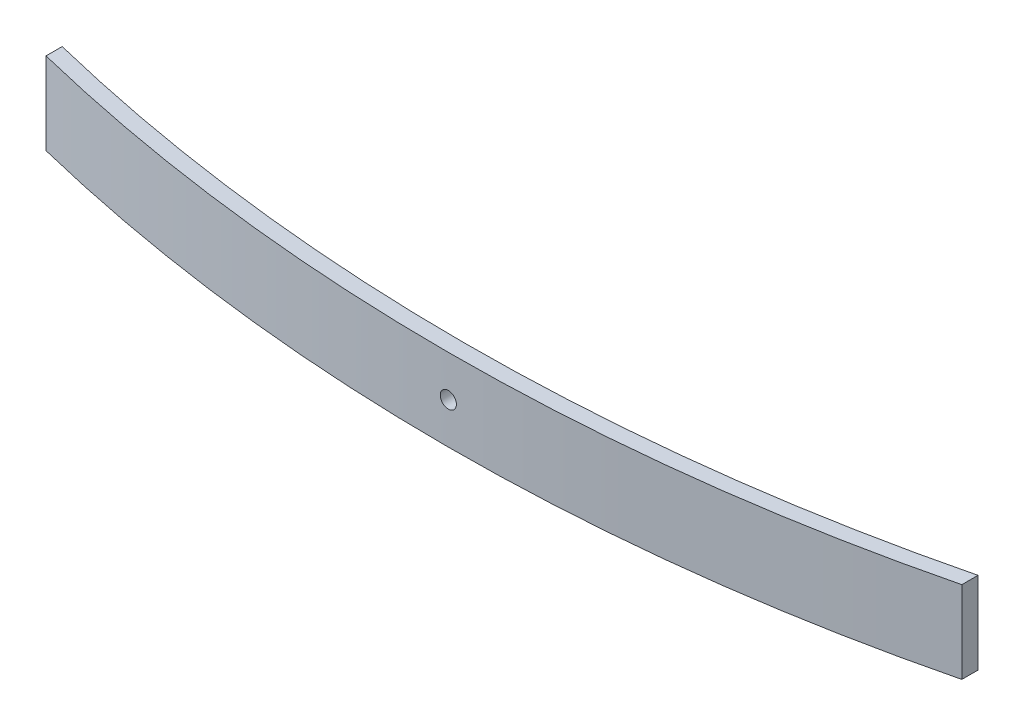
ISO-10303-21;
HEADER;
FILE_DESCRIPTION(('STEP AP214'),'2;1');
FILE_NAME('part.step','',(''),(''),'','','');
FILE_SCHEMA(('AUTOMOTIVE_DESIGN { 1 0 10303 214 1 1 1 1 }'));
ENDSEC;
DATA;
#1=APPLICATION_CONTEXT('core data for automotive mechanical design processes');
#2=APPLICATION_PROTOCOL_DEFINITION('international standard','automotive_design',2000,#1);
#3=PRODUCT_CONTEXT('',#1,'mechanical');
#4=PRODUCT('Part','Part','',(#3));
#5=PRODUCT_RELATED_PRODUCT_CATEGORY('part','',(#4));
#6=PRODUCT_DEFINITION_FORMATION('','',#4);
#7=PRODUCT_DEFINITION_CONTEXT('part definition',#1,'design');
#8=PRODUCT_DEFINITION('design','',#6,#7);
#9=PRODUCT_DEFINITION_SHAPE('','',#8);
#10=(LENGTH_UNIT() NAMED_UNIT(*) SI_UNIT(.MILLI.,.METRE.));
#11=(NAMED_UNIT(*) PLANE_ANGLE_UNIT() SI_UNIT($,.RADIAN.));
#12=(NAMED_UNIT(*) SI_UNIT($,.STERADIAN.) SOLID_ANGLE_UNIT());
#13=UNCERTAINTY_MEASURE_WITH_UNIT(LENGTH_MEASURE(1.E-05),#10,'distance_accuracy_value','');
#14=(GEOMETRIC_REPRESENTATION_CONTEXT(3) GLOBAL_UNCERTAINTY_ASSIGNED_CONTEXT((#13)) GLOBAL_UNIT_ASSIGNED_CONTEXT((#10,
#11,#12)) REPRESENTATION_CONTEXT('',''));
#15=CARTESIAN_POINT('',(0.,0.,0.));
#16=DIRECTION('',(0.,0.,1.));
#17=DIRECTION('',(1.,0.,0.));
#18=AXIS2_PLACEMENT_3D('',#15,#16,#17);
#19=CARTESIAN_POINT('',(5.59449830648205E-13,76.2,-1553.04997748711));
#20=DIRECTION('',(0.,-1.,0.));
#21=DIRECTION('',(0.,0.,-1.));
#22=AXIS2_PLACEMENT_3D('',#19,#20,#21);
#23=CYLINDRICAL_SURFACE('',#22,1776.04997748711);
#24=CARTESIAN_POINT('',(5.59449830648205E-13,0.,-1553.04997748711));
#25=DIRECTION('',(0.,1.,0.));
#26=DIRECTION('',(0.,0.,1.));
#27=AXIS2_PLACEMENT_3D('',#24,#25,#26);
#28=CIRCLE('',#27,1776.04997748711);
#29=CARTESIAN_POINT('',(425.021699517166,0.,171.394883177186));
#30=VERTEX_POINT('',#29);
#31=CARTESIAN_POINT('',(-425.021699517165,0.,171.394883177187));
#32=VERTEX_POINT('',#31);
#33=EDGE_CURVE('E122',#30,#32,#28,.F.);
#34=ORIENTED_EDGE('',*,*,#33,.F.);
#35=DIRECTION('',(0.,-1.,0.));
#36=VECTOR('',#35,1.);
#37=CARTESIAN_POINT('',(425.021699517166,76.2,171.394883177186));
#38=LINE('',#37,#36);
#39=CARTESIAN_POINT('',(425.021699517166,76.2,171.394883177186));
#40=VERTEX_POINT('',#39);
#41=EDGE_CURVE('E11',#40,#30,#38,.T.);
#42=ORIENTED_EDGE('',*,*,#41,.F.);
#43=CARTESIAN_POINT('',(5.59449830648205E-13,76.2,-1553.04997748711));
#44=DIRECTION('',(0.,1.,0.));
#45=DIRECTION('',(0.,0.,1.));
#46=AXIS2_PLACEMENT_3D('',#43,#44,#45);
#47=CIRCLE('',#46,1776.04997748711);
#48=CARTESIAN_POINT('',(-425.021699517165,76.2,171.394883177187));
#49=VERTEX_POINT('',#48);
#50=EDGE_CURVE('E115',#40,#49,#47,.F.);
#51=ORIENTED_EDGE('',*,*,#50,.T.);
#52=DIRECTION('',(0.,-1.,0.));
#53=VECTOR('',#52,1.);
#54=CARTESIAN_POINT('',(-425.021699517165,76.2,171.394883177187));
#55=LINE('',#54,#53);
#56=EDGE_CURVE('E94',#49,#32,#55,.T.);
#57=ORIENTED_EDGE('',*,*,#56,.T.);
#58=EDGE_LOOP('',(#34,#42,#51,#57));
#59=FACE_BOUND('',#58,.T.);
#60=CARTESIAN_POINT('',(5.59449830648205E-13,30.6,223.));
#61=CARTESIAN_POINT('',(-0.210713968094359,30.5999984867718,223.000000017793));
#62=CARTESIAN_POINT('',(-0.421403110930439,30.6088837241473,222.999962421728));
#63=CARTESIAN_POINT('',(-0.841354181845206,30.6443626478278,222.999813125687));
#64=CARTESIAN_POINT('',(-1.05061571988385,30.6709609920997,222.99970140622));
#65=CARTESIAN_POINT('',(-1.46633777348665,30.7417152082758,222.999406859924));
#66=CARTESIAN_POINT('',(-1.67279562512332,30.7858867143382,222.999223969782));
#67=CARTESIAN_POINT('',(-2.08132982906143,30.8914915499315,222.998792209094));
#68=CARTESIAN_POINT('',(-2.28340455125367,30.9529311869031,222.998543314441));
#69=CARTESIAN_POINT('',(-2.68152110119514,31.0925814227027,222.997986836869));
#70=CARTESIAN_POINT('',(-2.8775668723038,31.1707807807114,222.997679293301));
#71=CARTESIAN_POINT('',(-3.26237590887513,31.343419913298,222.997014137911));
#72=CARTESIAN_POINT('',(-3.45113906456097,31.4378599325676,222.996656525334));
#73=CARTESIAN_POINT('',(-3.81998780495984,31.6422805388216,222.995901490769));
#74=CARTESIAN_POINT('',(-4.00007570143485,31.7522569546404,222.995504079474));
#75=CARTESIAN_POINT('',(-4.35035222525608,31.9869905222909,222.994680636078));
#76=CARTESIAN_POINT('',(-4.52054062300119,32.1117480167396,222.994254603313));
#77=CARTESIAN_POINT('',(-4.84979170206691,32.3751451316167,222.99338604845));
#78=CARTESIAN_POINT('',(-5.00885520931077,32.5137837196362,222.992943527578));
#79=CARTESIAN_POINT('',(-5.31479308067798,32.8040158599571,222.992054369382));
#80=CARTESIAN_POINT('',(-5.46166320475911,32.9556138817968,222.991607730686));
#81=CARTESIAN_POINT('',(-5.74206362701615,33.2705952098564,222.990723311728));
#82=CARTESIAN_POINT('',(-5.87559815641346,33.4339747494297,222.990285528692));
#83=CARTESIAN_POINT('',(-6.12847828337025,33.7714630692386,222.989430939819));
#84=CARTESIAN_POINT('',(-6.24781862373899,33.9455757887629,222.989014141786));
#85=CARTESIAN_POINT('',(-6.47138111476831,34.303200530957,222.988213616074));
#86=CARTESIAN_POINT('',(-6.5756063932153,34.4867105983515,222.987829881559));
#87=CARTESIAN_POINT('',(-6.76822875919954,34.8618615632204,222.987106273531));
#88=CARTESIAN_POINT('',(-6.8566256006593,35.0535025870457,222.986766400699));
#89=CARTESIAN_POINT('',(-7.01695887812269,35.4435460971776,222.986140178145));
#90=CARTESIAN_POINT('',(-7.08889566823621,35.6419484379206,222.98585382727));
#91=CARTESIAN_POINT('',(-7.21580133308603,36.0441127387915,222.985342762279));
#92=CARTESIAN_POINT('',(-7.27076981084051,36.2478748241923,222.985118049606));
#93=CARTESIAN_POINT('',(-7.3633369917847,36.6592665254966,222.984736685149));
#94=CARTESIAN_POINT('',(-7.40093897454978,36.8668954034649,222.984580020516));
#95=CARTESIAN_POINT('',(-7.45853120590767,37.2846549482941,222.984339094535));
#96=CARTESIAN_POINT('',(-7.47851535225068,37.4947864564639,222.984254858275));
#97=CARTESIAN_POINT('',(-7.5007035967929,37.9159102543567,222.984161289859));
#98=CARTESIAN_POINT('',(-7.50291408330494,38.12690220753,222.98415193079));
#99=CARTESIAN_POINT('',(-7.48955360463758,38.5484004665778,222.984208322118));
#100=CARTESIAN_POINT('',(-7.47397607404447,38.758906564384,222.984274100248));
#101=CARTESIAN_POINT('',(-7.42514452560695,39.177816026816,222.984478922777));
#102=CARTESIAN_POINT('',(-7.39189401428345,39.3862198002115,222.984617952643));
#103=CARTESIAN_POINT('',(-7.30795445093896,39.799488675094,222.984965325869));
#104=CARTESIAN_POINT('',(-7.25726512758638,40.0043537214696,222.985173670308));
#105=CARTESIAN_POINT('',(-7.13880941808664,40.4090816554469,222.985653753507));
#106=CARTESIAN_POINT('',(-7.07104334628337,40.6089446350508,222.9859254911));
#107=CARTESIAN_POINT('',(-6.9189140997811,41.0022558470399,222.986524655178));
#108=CARTESIAN_POINT('',(-6.83455053674644,41.1957039292103,222.986852082967));
#109=CARTESIAN_POINT('',(-6.64984230973407,41.5747716673118,222.987553267696));
#110=CARTESIAN_POINT('',(-6.54950055498276,41.7603927405774,222.987927016201));
#111=CARTESIAN_POINT('',(-6.33350673998455,42.1225834438656,222.988710406047));
#112=CARTESIAN_POINT('',(-6.21784939085673,42.2991499177422,222.989120059772));
#113=CARTESIAN_POINT('',(-5.97209494733994,42.6418601532704,222.98996341449));
#114=CARTESIAN_POINT('',(-5.84200303653235,42.8080076231481,222.990397106822));
#115=CARTESIAN_POINT('',(-5.56830511634756,43.1287715124284,222.991276344151));
#116=CARTESIAN_POINT('',(-5.42469413510179,43.2833836517495,222.991721893463));
#117=CARTESIAN_POINT('',(-4.97502421482223,43.728168500476,222.993057195178));
#118=CARTESIAN_POINT('',(-4.64986305950523,43.9996590137953,222.993946551662));
#119=CARTESIAN_POINT('',(-4.13197567971263,44.3627081259285,222.995201923407));
#120=CARTESIAN_POINT('',(-3.95423770702148,44.4764002086071,222.99560743072));
#121=CARTESIAN_POINT('',(-3.58980904910994,44.688450679073,222.996381434127));
#122=CARTESIAN_POINT('',(-3.40311815449547,44.7868087079932,222.996749929354));
#123=CARTESIAN_POINT('',(-2.83165300721137,45.0576661242203,222.99778332722));
#124=CARTESIAN_POINT('',(-2.43517114126776,45.2061693090256,222.998376934446));
#125=CARTESIAN_POINT('',(-1.62308827124602,45.4344169166339,222.999304792558));
#126=CARTESIAN_POINT('',(-1.20748726904302,45.5141613461806,222.999639043471));
#127=CARTESIAN_POINT('',(-0.368800144783705,45.6027859953174,223.000011208189));
#128=CARTESIAN_POINT('',(0.0542859194174502,45.6116667624026,223.000049124283));
#129=CARTESIAN_POINT('',(0.89613261813084,45.5581931101372,222.999823726226));
#130=CARTESIAN_POINT('',(1.31489325255125,45.4958386892741,222.999560412068));
#131=CARTESIAN_POINT('',(1.93034367877353,45.3504066256681,222.998962948761));
#132=CARTESIAN_POINT('',(2.13346696571742,45.2932419084604,222.998729895662));
#133=CARTESIAN_POINT('',(2.5341633176814,45.1620457959662,222.998203357605));
#134=CARTESIAN_POINT('',(2.73173651249186,45.0880147954716,222.997909874061));
#135=CARTESIAN_POINT('',(3.31406084676296,44.8412313409883,222.996950242198));
#136=CARTESIAN_POINT('',(3.68878109502314,44.6437020734129,222.996204537468));
#137=CARTESIAN_POINT('',(4.2214817885536,44.3027303934533,222.99499198449));
#138=CARTESIAN_POINT('',(4.39423732139167,44.1815494254653,222.99457188216));
#139=CARTESIAN_POINT('',(4.72893486876232,43.9250760102941,222.993712173887));
#140=CARTESIAN_POINT('',(4.89088085068062,43.7897887877035,222.993272575197));
#141=CARTESIAN_POINT('',(5.20283897410459,43.5060131269227,222.992386135608));
#142=CARTESIAN_POINT('',(5.35284682055907,43.3575199778824,222.991939292171));
#143=CARTESIAN_POINT('',(5.63977310900379,43.0484737070597,222.99105133538));
#144=CARTESIAN_POINT('',(5.77669606336983,42.8879247771164,222.990610220097));
#145=CARTESIAN_POINT('',(6.03655633591662,42.5558335361284,222.989746002998));
#146=CARTESIAN_POINT('',(6.15949097179744,42.3842891264948,222.989322904648));
#147=CARTESIAN_POINT('',(6.39046942201523,42.0314575902562,222.98850682996));
#148=CARTESIAN_POINT('',(6.49851358458251,41.8501706916281,222.988113852919));
#149=CARTESIAN_POINT('',(6.69894774113194,41.4791360457972,222.987369158747));
#150=CARTESIAN_POINT('',(6.79133744698049,41.2893881429437,222.987017442377));
#151=CARTESIAN_POINT('',(6.95980221242444,40.9027865931228,222.986365267457));
#152=CARTESIAN_POINT('',(7.03587752593875,40.705933056804,222.986064808109));
#153=CARTESIAN_POINT('',(7.17118720449912,40.3064792017959,222.985523618733));
#154=CARTESIAN_POINT('',(7.23041839084972,40.1038778063372,222.985282899979));
#155=CARTESIAN_POINT('',(7.33158072491739,39.6944803968456,222.98486817799));
#156=CARTESIAN_POINT('',(7.37351824975517,39.4876859585838,222.984694150165));
#157=CARTESIAN_POINT('',(7.43983858987235,39.0712246263163,222.984417572838));
#158=CARTESIAN_POINT('',(7.4642150889778,38.8615567264145,222.984315049055));
#159=CARTESIAN_POINT('',(7.49521005598158,38.4409854893945,222.984184515179));
#160=CARTESIAN_POINT('',(7.50183466739308,38.2300826050058,222.984156479306));
#161=CARTESIAN_POINT('',(7.49729604901428,37.8084313167292,222.984175644233));
#162=CARTESIAN_POINT('',(7.48612970385176,37.5976829463638,222.984222858209));
#163=CARTESIAN_POINT('',(7.44608319144547,37.1778810074965,222.984391205324));
#164=CARTESIAN_POINT('',(7.41720343879291,36.9688273994438,222.984512336734));
#165=CARTESIAN_POINT('',(7.34193498439921,36.5538917028778,222.984825082016));
#166=CARTESIAN_POINT('',(7.29554590651523,36.3480096825967,222.985016697403));
#167=CARTESIAN_POINT('',(7.18558954382438,35.940888673502,222.985464967259));
#168=CARTESIAN_POINT('',(7.12202252604803,35.7396496125665,222.985721620717));
#169=CARTESIAN_POINT('',(6.97814667319743,35.3431999543693,222.986292743017));
#170=CARTESIAN_POINT('',(6.89783430858557,35.1479906380157,222.986607224045));
#171=CARTESIAN_POINT('',(6.72107980430777,34.7651040508121,222.987284909401));
#172=CARTESIAN_POINT('',(6.62464362886664,34.5774240265771,222.987648095704));
#173=CARTESIAN_POINT('',(6.4162729052852,34.210795083937,222.988413096412));
#174=CARTESIAN_POINT('',(6.30433343128906,34.0318489650877,222.988814923083));
#175=CARTESIAN_POINT('',(6.06581689289934,33.684084736122,222.989645553126));
#176=CARTESIAN_POINT('',(5.93924490882288,33.5152631415669,222.990074347111));
#177=CARTESIAN_POINT('',(5.67231991868928,33.1888660580896,222.990946907972));
#178=CARTESIAN_POINT('',(5.53196570521919,33.031291556578,222.991390676157));
#179=CARTESIAN_POINT('',(5.23848659589234,32.728528501031,222.992280544971));
#180=CARTESIAN_POINT('',(5.08536199605376,32.583339660053,222.992726645546));
#181=CARTESIAN_POINT('',(4.76738488124506,32.3063385507571,222.993608647807));
#182=CARTESIAN_POINT('',(4.60252923302727,32.1745298791339,222.994044546725));
#183=CARTESIAN_POINT('',(4.26230143452273,31.9252727160437,222.994893638276));
#184=CARTESIAN_POINT('',(4.08692944268934,31.8078240082911,222.995306831249));
#185=CARTESIAN_POINT('',(3.72679224644641,31.5880456665331,222.996099052417));
#186=CARTESIAN_POINT('',(3.54202080718467,31.4857262486001,222.996478057459));
#187=CARTESIAN_POINT('',(3.16457932589544,31.2970641063271,222.997190684133));
#188=CARTESIAN_POINT('',(2.97191219636475,31.2107155544448,222.997524322307));
#189=CARTESIAN_POINT('',(2.58015719959604,31.0546324777028,222.998136625653));
#190=CARTESIAN_POINT('',(2.38107520557387,30.9848832197952,222.998415339535));
#191=CARTESIAN_POINT('',(1.97781144430207,30.8624129523239,222.998910200255));
#192=CARTESIAN_POINT('',(1.77363103212953,30.8096874689386,222.999126363529));
#193=CARTESIAN_POINT('',(1.31020489979083,30.7106430274462,222.999535351372));
#194=CARTESIAN_POINT('',(1.04990557260813,30.6691871109607,222.99970896714));
#195=CARTESIAN_POINT('',(0.526391255000916,30.6138665423076,222.999941280343));
#196=CARTESIAN_POINT('',(0.263176264593039,30.6000018899827,222.999999977777));
#197=CARTESIAN_POINT('',(5.59449830648205E-13,30.6,223.));
#198=B_SPLINE_CURVE_WITH_KNOTS('',3,(#60,#61,#62,#63,#64,#65,#66,#67,#68,#69,#70,#71,#72,#73,
#74,#75,#76,#77,#78,#79,#80,#81,#82,#83,#84,#85,#86,#87,#88,#89,#90,#91,#92,#93,#94,#95,#96,#97,
#98,#99,#100,#101,#102,#103,#104,#105,#106,#107,#108,#109,#110,#111,#112,#113,#114,#115,#116,
#117,#118,#119,#120,#121,#122,#123,#124,#125,#126,#127,#128,#129,#130,#131,#132,#133,#134,#135,
#136,#137,#138,#139,#140,#141,#142,#143,#144,#145,#146,#147,#148,#149,#150,#151,#152,#153,#154,
#155,#156,#157,#158,#159,#160,#161,#162,#163,#164,#165,#166,#167,#168,#169,#170,#171,#172,#173,
#174,#175,#176,#177,#178,#179,#180,#181,#182,#183,#184,#185,#186,#187,#188,#189,#190,#191,#192,
#193,#194,#195,#196,#197),.UNSPECIFIED.,.T.,.F.,(4,2,2,2,2,2,2,2,2,2,2,2,2,2,2,2,2,2,2,2,2,2,2,
2,2,2,2,2,2,2,2,2,2,2,2,2,2,2,2,2,2,2,2,2,2,2,2,2,2,2,2,2,2,2,2,2,2,2,2,2,2,2,2,2,2,2,2,2,4),
(0.,0.631912024301777,1.2639902864152,1.89663214600144,2.52950538839113,3.16195548087539,
3.79441510307562,4.4267052459563,5.05901004782971,5.69126785680884,6.3237446098031,
6.95602004377836,7.58852893310258,8.22090674891289,8.85329439515874,9.48566843538515,
10.1180572691842,10.7503266306474,11.3828149038618,12.0150758342728,12.6475702025455,
13.2799391235442,13.9123178840565,14.5446850047721,15.177066922899,15.8093338315781,
16.4418196509556,17.0740790696136,17.7065719276866,18.9702098092056,19.602583667419,
20.2349723230349,21.4986105469059,22.7622486468442,24.0258769838608,25.2895053477042,
25.9218869189979,26.5542536895501,27.8178774792359,28.450372115571,29.0826333187677,
29.7151209754032,30.3473897231102,30.9797795065627,31.6121544983652,32.2445411283047,
32.8769179149983,33.5094139599539,34.1416765599364,34.7741664524213,35.4064374266601,
36.0388191299599,36.6711860326123,37.3035665208154,37.9359371792494,38.5684412619989,
39.2007118959496,39.8331838838019,40.4654369370645,41.097745429307,41.7300392686787,
42.3625026260201,42.9949564562123,43.6278354202829,44.2604829982539,44.892566944869,
45.5244846453389,46.3137263294984,47.1029680091572),.UNSPECIFIED.);
#199=CARTESIAN_POINT('',(5.59449830648205E-13,30.6,223.));
#200=VERTEX_POINT('',#199);
#201=EDGE_CURVE('E125',#200,#200,#198,.T.);
#202=ORIENTED_EDGE('',*,*,#201,.T.);
#203=EDGE_LOOP('',(#202));
#204=FACE_BOUND('',#203,.T.);
#205=ADVANCED_FACE('F49',(#59,#204),#23,.T.);
#206=CARTESIAN_POINT('',(5.63227548411192E-13,76.2,-1568.04997748713));
#207=DIRECTION('',(0.,-1.,0.));
#208=DIRECTION('',(0.,0.,-1.));
#209=AXIS2_PLACEMENT_3D('',#206,#207,#208);
#210=CYLINDRICAL_SURFACE('',#209,1776.04997748713);
#211=CARTESIAN_POINT('',(5.63227548411192E-13,0.,-1568.04997748713));
#212=DIRECTION('',(0.,1.,0.));
#213=DIRECTION('',(0.,0.,1.));
#214=AXIS2_PLACEMENT_3D('',#211,#212,#213);
#215=CIRCLE('',#214,1776.04997748713);
#216=CARTESIAN_POINT('',(425.021699517166,0.,156.394883177186));
#217=VERTEX_POINT('',#216);
#218=CARTESIAN_POINT('',(-425.021699517165,0.,156.394883177187));
#219=VERTEX_POINT('',#218);
#220=EDGE_CURVE('E87',#217,#219,#215,.F.);
#221=ORIENTED_EDGE('',*,*,#220,.T.);
#222=DIRECTION('',(0.,-1.,0.));
#223=VECTOR('',#222,1.);
#224=CARTESIAN_POINT('',(-425.021699517165,76.2,156.394883177187));
#225=LINE('',#224,#223);
#226=CARTESIAN_POINT('',(-425.021699517165,76.2,156.394883177187));
#227=VERTEX_POINT('',#226);
#228=EDGE_CURVE('E108',#227,#219,#225,.T.);
#229=ORIENTED_EDGE('',*,*,#228,.F.);
#230=CARTESIAN_POINT('',(5.63227548411192E-13,76.2,-1568.04997748713));
#231=DIRECTION('',(0.,1.,0.));
#232=DIRECTION('',(0.,0.,1.));
#233=AXIS2_PLACEMENT_3D('',#230,#231,#232);
#234=CIRCLE('',#233,1776.04997748713);
#235=CARTESIAN_POINT('',(425.021699517166,76.2,156.394883177186));
#236=VERTEX_POINT('',#235);
#237=EDGE_CURVE('E110',#236,#227,#234,.F.);
#238=ORIENTED_EDGE('',*,*,#237,.F.);
#239=DIRECTION('',(0.,-1.,0.));
#240=VECTOR('',#239,1.);
#241=CARTESIAN_POINT('',(425.021699517166,76.2,156.394883177186));
#242=LINE('',#241,#240);
#243=EDGE_CURVE('E64',#236,#217,#242,.T.);
#244=ORIENTED_EDGE('',*,*,#243,.T.);
#245=EDGE_LOOP('',(#221,#229,#238,#244));
#246=FACE_BOUND('',#245,.T.);
#247=CARTESIAN_POINT('',(-7.5,38.1,207.984164226377));
#248=CARTESIAN_POINT('',(-7.50000151322819,38.3107139680855,207.984164208571));
#249=CARTESIAN_POINT('',(-7.49111627585349,38.5214031109122,207.984201804954));
#250=CARTESIAN_POINT('',(-7.45563735217615,38.9413541818078,207.984351102375));
#251=CARTESIAN_POINT('',(-7.42903900790671,39.1506157198367,207.984462822906));
#252=CARTESIAN_POINT('',(-7.35828479173724,39.56633777342,207.984757371678));
#253=CARTESIAN_POINT('',(-7.31411328567894,39.7727956250468,207.984940263236));
#254=CARTESIAN_POINT('',(-7.208508450096,40.181329828965,207.985372027225));
#255=CARTESIAN_POINT('',(-7.14706881313061,40.3834045511471,207.985620923766));
#256=CARTESIAN_POINT('',(-7.00741857734594,40.781521101067,207.98617740523));
#257=CARTESIAN_POINT('',(-6.92921921934607,40.9775668721644,207.986484950802));
#258=CARTESIAN_POINT('',(-6.75658008677935,41.362375908714,207.987150110131));
#259=CARTESIAN_POINT('',(-6.66214006752074,41.5511390643896,207.987507724643));
#260=CARTESIAN_POINT('',(-6.45771946129041,41.9199878047696,207.988262762777));
#261=CARTESIAN_POINT('',(-6.34774304548433,42.1000757012362,207.988660175705));
#262=CARTESIAN_POINT('',(-6.11300947786033,42.4503522250429,207.989483621892));
#263=CARTESIAN_POINT('',(-5.98825198342546,42.6205406227819,207.989909655814));
#264=CARTESIAN_POINT('',(-5.72485486856214,42.9497917018563,207.990778212374));
#265=CARTESIAN_POINT('',(-5.58621628054089,43.1088552091137,207.991220733785));
#266=CARTESIAN_POINT('',(-5.29598414021393,43.4147930805081,207.992109892413));
#267=CARTESIAN_POINT('',(-5.14438611836974,43.5616632046028,207.992556531002));
#268=CARTESIAN_POINT('',(-4.82940479029845,43.8420636268864,207.993440949047));
#269=CARTESIAN_POINT('',(-4.66602525071787,43.9755981562967,207.993878731278));
#270=CARTESIAN_POINT('',(-4.32853693089197,44.2284782832785,207.994733317997));
#271=CARTESIAN_POINT('',(-4.15442421135789,44.3478186236592,207.99515011468));
#272=CARTESIAN_POINT('',(-3.79679946915635,44.5713811147018,207.995950637268));
#273=CARTESIAN_POINT('',(-3.61328940176485,44.6756063931513,207.996334370008));
#274=CARTESIAN_POINT('',(-3.23813843690194,44.868228759141,207.997057974285));
#275=CARTESIAN_POINT('',(-3.04649741307953,44.9566256006036,207.997397845139));
#276=CARTESIAN_POINT('',(-2.65645390295346,45.116958878073,207.998024063725));
#277=CARTESIAN_POINT('',(-2.4580515622135,45.1888956681897,207.998310412606));
#278=CARTESIAN_POINT('',(-2.05588726134914,45.3158013330459,207.998821473858));
#279=CARTESIAN_POINT('',(-1.85212517595196,45.3707698108037,207.999046184785));
#280=CARTESIAN_POINT('',(-1.44073347465677,45.4633369917546,207.999427546169));
#281=CARTESIAN_POINT('',(-1.23310459669404,45.5009389745232,207.999584209476));
#282=CARTESIAN_POINT('',(-0.815345051876459,45.5585312058889,207.999825133398));
#283=CARTESIAN_POINT('',(-0.605213543712588,45.5785153522362,207.999909368927));
#284=CARTESIAN_POINT('',(-0.184089745831485,45.6007035967881,208.000002936514));
#285=CARTESIAN_POINT('',(0.0269022073360927,45.6029140833055,208.000012295484));
#286=CARTESIAN_POINT('',(0.448400466373139,45.5895536046497,207.999955904647));
#287=CARTESIAN_POINT('',(0.658906564174369,45.5739760740628,207.999890127109));
#288=CARTESIAN_POINT('',(1.07781602663256,45.5251445256344,207.999685306357));
#289=CARTESIAN_POINT('',(1.28621980005893,45.4918940143109,207.999546277678));
#290=CARTESIAN_POINT('',(1.69948867500321,45.407954450961,207.999198907313));
#291=CARTESIAN_POINT('',(1.90435372140974,45.357265127603,207.998990564549));
#292=CARTESIAN_POINT('',(2.30908165544806,45.2388094180872,207.998510484954));
#293=CARTESIAN_POINT('',(2.50894463508202,45.1710433462732,207.998238749291));
#294=CARTESIAN_POINT('',(2.90225584712975,45.0189140997444,207.997639589155));
#295=CARTESIAN_POINT('',(3.09570392932878,44.9345505366938,207.997312163378));
#296=CARTESIAN_POINT('',(3.47477166746599,44.7498423096539,207.996610982502));
#297=CARTESIAN_POINT('',(3.6603927407395,44.6495005548925,207.996237235837));
#298=CARTESIAN_POINT('',(4.02258344404181,44.433506739873,207.995453849319));
#299=CARTESIAN_POINT('',(4.1991499179246,44.3178493907339,207.995044197084));
#300=CARTESIAN_POINT('',(4.5418601534629,44.0720949471939,207.994200844778));
#301=CARTESIAN_POINT('',(4.70800762334451,43.9420030363744,207.993767153369));
#302=CARTESIAN_POINT('',(5.02877151263007,43.6683051161658,207.992887917265));
#303=CARTESIAN_POINT('',(5.18338365195257,43.524694134908,207.992442368252));
#304=CARTESIAN_POINT('',(5.62816850065028,43.075024214623,207.991107066408));
#305=CARTESIAN_POINT('',(5.89965901394052,42.7498630593184,207.990217708469));
#306=CARTESIAN_POINT('',(6.26270812603403,42.231975679552,207.988962332908));
#307=CARTESIAN_POINT('',(6.37640020870004,42.0542377068708,207.988556824049));
#308=CARTESIAN_POINT('',(6.58845067914274,41.689809048981,207.987782817222));
#309=CARTESIAN_POINT('',(6.68680870805227,41.5031181543784,207.987414320118));
#310=CARTESIAN_POINT('',(6.95766612427186,40.9316530070874,207.986380916429));
#311=CARTESIAN_POINT('',(7.10616930907641,40.5351711411231,207.985787305057));
#312=CARTESIAN_POINT('',(7.33441691667697,39.7230882710565,207.98485943989));
#313=CARTESIAN_POINT('',(7.4141613462167,39.3074872688294,207.98452518607));
#314=CARTESIAN_POINT('',(7.50278599532745,38.4688001445599,207.98415301811));
#315=CARTESIAN_POINT('',(7.51166676240022,38.0457140803734,207.984115101681));
#316=CARTESIAN_POINT('',(7.45819311011506,37.2038673816925,207.984340501734));
#317=CARTESIAN_POINT('',(7.39583868924482,36.7851067472898,207.984603818222));
#318=CARTESIAN_POINT('',(7.25040662563846,36.1696563211186,207.985201286275));
#319=CARTESIAN_POINT('',(7.19324190843678,35.9665330342062,207.985434341165));
#320=CARTESIAN_POINT('',(7.06204579596008,35.5658366823044,207.98596088302));
#321=CARTESIAN_POINT('',(6.988014795477,35.3682634875246,207.986254368569));
#322=CARTESIAN_POINT('',(6.74123134103598,34.7859391533421,207.987214006388));
#323=CARTESIAN_POINT('',(6.54370207349932,34.4112189051374,207.987959715012));
#324=CARTESIAN_POINT('',(6.20273039359089,33.8785182116486,207.98917227251));
#325=CARTESIAN_POINT('',(6.08154942560718,33.7057626788045,207.989592376125));
#326=CARTESIAN_POINT('',(5.82507601044284,33.3710651314208,207.990452086404));
#327=CARTESIAN_POINT('',(5.68978878785503,33.2091191494955,207.990891685812));
#328=CARTESIAN_POINT('',(5.40601312707813,32.8971610260567,207.991778126146));
#329=CARTESIAN_POINT('',(5.25751997803879,32.7471531795944,207.992224969611));
#330=CARTESIAN_POINT('',(4.9484737072162,32.4602268911334,207.993112925805));
#331=CARTESIAN_POINT('',(4.78792477727201,32.3233039367589,207.993554040465));
#332=CARTESIAN_POINT('',(4.45583353628019,32.0634436641952,207.994418255711));
#333=CARTESIAN_POINT('',(4.28428912664368,31.9405090283059,207.994841352831));
#334=CARTESIAN_POINT('',(3.9314575903977,31.7095305780716,207.995657424618));
#335=CARTESIAN_POINT('',(3.75017069176505,31.6014864154963,207.996050399988));
#336=CARTESIAN_POINT('',(3.37913604592411,31.4010522589318,207.99679509052));
#337=CARTESIAN_POINT('',(3.18938814306502,31.3086625530762,207.997146804922));
#338=CARTESIAN_POINT('',(2.80278659323258,31.1401977876195,207.997798975874));
#339=CARTESIAN_POINT('',(2.60593305690778,31.0641224740995,207.998099433222));
#340=CARTESIAN_POINT('',(2.20647920190445,30.9288127955346,207.998640618766));
#341=CARTESIAN_POINT('',(2.00387780645707,30.8695816091838,207.998881335688));
#342=CARTESIAN_POINT('',(1.59448039698904,30.7684192751141,207.999296054415));
#343=CARTESIAN_POINT('',(1.38768595873947,30.7264817502745,207.99947008081));
#344=CARTESIAN_POINT('',(0.971224626496976,30.6601614101516,207.999746655793));
#345=CARTESIAN_POINT('',(0.761556726607797,30.6357849110423,207.999849178662));
#346=CARTESIAN_POINT('',(0.340985489613206,30.6047899440287,207.999979711378));
#347=CARTESIAN_POINT('',(0.130082605237182,30.5981653326113,208.000007747002));
#348=CARTESIAN_POINT('',(-0.291568683048701,30.6027039509765,207.999988582247));
#349=CARTESIAN_POINT('',(-0.502317053436057,30.6138702961342,207.99994136869));
#350=CARTESIAN_POINT('',(-0.922118992347881,30.6539168085346,207.999773023057));
#351=CARTESIAN_POINT('',(-1.13117260042308,30.6827965611862,207.99965189271));
#352=CARTESIAN_POINT('',(-1.54610829703443,30.7580650155817,207.999339150039));
#353=CARTESIAN_POINT('',(-1.75199031733826,30.8044540934685,207.9991475362));
#354=CARTESIAN_POINT('',(-2.15911132647842,30.9144104561691,207.998699269789));
#355=CARTESIAN_POINT('',(-2.36035038743661,30.9779774739523,207.998442618228));
#356=CARTESIAN_POINT('',(-2.75680004567823,31.1218533268206,207.997871499834));
#357=CARTESIAN_POINT('',(-2.95200936205342,31.2021656914433,207.997557020813));
#358=CARTESIAN_POINT('',(-3.33489594929876,31.3789201957465,207.99687933939));
#359=CARTESIAN_POINT('',(-3.52257597355381,31.4753563712022,207.996516155014));
#360=CARTESIAN_POINT('',(-3.88920491623113,31.6837270948159,207.995751157795));
#361=CARTESIAN_POINT('',(-4.06815103509761,31.7956665688298,207.995349332688));
#362=CARTESIAN_POINT('',(-4.41591526409443,32.0341831072574,207.994518705298));
#363=CARTESIAN_POINT('',(-4.58473685866347,32.1607550913541,207.994089912401));
#364=CARTESIAN_POINT('',(-4.9111339421384,32.4276800815085,207.993217353088));
#365=CARTESIAN_POINT('',(-5.0687084436356,32.568034294977,207.992773585362));
#366=CARTESIAN_POINT('',(-5.37147149915388,32.8615134042977,207.991883716795));
#367=CARTESIAN_POINT('',(-5.51666034011746,33.0146380041317,207.991437616009));
#368=CARTESIAN_POINT('',(-5.79366144938521,33.3326151189285,207.99055561267));
#369=CARTESIAN_POINT('',(-5.9254701209946,33.4974707671389,207.990119712884));
#370=CARTESIAN_POINT('',(-6.17472728405847,33.8376985656261,207.989270619054));
#371=CARTESIAN_POINT('',(-6.29217599179848,34.0130705574494,207.988857424669));
#372=CARTESIAN_POINT('',(-6.51195433354261,34.3732077536857,207.988065200255));
#373=CARTESIAN_POINT('',(-6.61427375147284,34.5579791929515,207.987686193377));
#374=CARTESIAN_POINT('',(-6.80293589374009,34.935420674249,207.986973562955));
#375=CARTESIAN_POINT('',(-6.88928444561938,35.1280878037838,207.986639922868));
#376=CARTESIAN_POINT('',(-7.04536752235468,35.5198428005607,207.98602761556));
#377=CARTESIAN_POINT('',(-7.11511678025874,35.7189247945869,207.985748899627));
#378=CARTESIAN_POINT('',(-7.23758704772251,36.1221885558675,207.985254035172));
#379=CARTESIAN_POINT('',(-7.29031253110391,36.3263689680447,207.985037870214));
#380=CARTESIAN_POINT('',(-7.38935697257925,36.789795100359,207.984628879072));
#381=CARTESIAN_POINT('',(-7.43081288905515,37.0500944275119,207.984455261811));
#382=CARTESIAN_POINT('',(-7.48613345769553,37.5736087450595,207.984222946583));
#383=CARTESIAN_POINT('',(-7.49999811001735,37.8368237354374,207.984164248617));
#384=CARTESIAN_POINT('',(-7.5,38.1,207.984164226377));
#385=B_SPLINE_CURVE_WITH_KNOTS('',3,(#247,#248,#249,#250,#251,#252,#253,#254,#255,#256,#257,
#258,#259,#260,#261,#262,#263,#264,#265,#266,#267,#268,#269,#270,#271,#272,#273,#274,#275,#276,
#277,#278,#279,#280,#281,#282,#283,#284,#285,#286,#287,#288,#289,#290,#291,#292,#293,#294,#295,
#296,#297,#298,#299,#300,#301,#302,#303,#304,#305,#306,#307,#308,#309,#310,#311,#312,#313,#314,
#315,#316,#317,#318,#319,#320,#321,#322,#323,#324,#325,#326,#327,#328,#329,#330,#331,#332,#333,
#334,#335,#336,#337,#338,#339,#340,#341,#342,#343,#344,#345,#346,#347,#348,#349,#350,#351,#352,
#353,#354,#355,#356,#357,#358,#359,#360,#361,#362,#363,#364,#365,#366,#367,#368,#369,#370,#371,
#372,#373,#374,#375,#376,#377,#378,#379,#380,#381,#382,#383,#384),.UNSPECIFIED.,.T.,.F.,(4,2,2,
2,2,2,2,2,2,2,2,2,2,2,2,2,2,2,2,2,2,2,2,2,2,2,2,2,2,2,2,2,2,2,2,2,2,2,2,2,2,2,2,2,2,2,2,2,2,2,2,
2,2,2,2,2,2,2,2,2,2,2,2,2,2,2,2,2,4),(0.,0.631912024273445,1.26399028635864,1.89663214591711,
2.52950538827904,3.16195548073079,3.79441510289857,4.42670524574721,5.05901004758862,
5.69126785660492,6.32374460963637,6.95602004364789,7.58852893300835,8.22090674880478,
8.85329439503678,9.48566843524987,10.1180572690357,10.7503266304816,11.3828149036786,
12.015075834073,12.6475702023291,13.2799391234167,13.9123178840178,14.5446850048214,
15.1770669230362,15.8093338317406,16.4418196511433,17.0740790698267,17.7065719279251,
18.9702098093706,19.6025836675478,20.2349723231275,21.4986105470723,22.7622486470823,
24.0258769840529,25.2895053478503,25.9218869190543,26.554253689517,27.8178774790259,
28.4503721153762,29.0826333185882,29.7151209752384,30.3473897229599,30.9797795064268,
31.6121544982437,32.2445411281974,32.8769179149054,33.5094139598227,34.1416765597668,
34.7741664522143,35.4064374264159,36.0388191297804,36.6711860324975,37.3035665207648,
37.9359371792628,38.5684412620756,39.2007118960893,39.8331838840045,40.4654369373297,
41.0977454295341,41.7300392688676,42.3625026261715,42.9949564563263,43.6278354204136,
44.2604829984013,44.8925669450324,45.524484645518,46.313726329588,47.1029680091571),.UNSPECIFIED.);
#386=CARTESIAN_POINT('',(-7.5,38.1,207.984164226377));
#387=VERTEX_POINT('',#386);
#388=EDGE_CURVE('E53',#387,#387,#385,.T.);
#389=ORIENTED_EDGE('',*,*,#388,.F.);
#390=EDGE_LOOP('',(#389));
#391=FACE_BOUND('',#390,.T.);
#392=ADVANCED_FACE('F111',(#246,#391),#210,.F.);
#393=CARTESIAN_POINT('',(425.021699517166,76.2,0.));
#394=DIRECTION('',(1.,0.,0.));
#395=DIRECTION('',(0.,0.,-1.));
#396=AXIS2_PLACEMENT_3D('',#393,#394,#395);
#397=PLANE('',#396);
#398=DIRECTION('',(0.,0.,1.));
#399=VECTOR('',#398,1.);
#400=CARTESIAN_POINT('',(425.021699517166,0.,0.));
#401=LINE('',#400,#399);
#402=EDGE_CURVE('E107',#217,#30,#401,.T.);
#403=ORIENTED_EDGE('',*,*,#402,.F.);
#404=ORIENTED_EDGE('',*,*,#243,.F.);
#405=DIRECTION('',(0.,0.,1.));
#406=VECTOR('',#405,1.);
#407=CARTESIAN_POINT('',(425.021699517166,76.2,0.));
#408=LINE('',#407,#406);
#409=EDGE_CURVE('E105',#236,#40,#408,.T.);
#410=ORIENTED_EDGE('',*,*,#409,.T.);
#411=ORIENTED_EDGE('',*,*,#41,.T.);
#412=EDGE_LOOP('',(#403,#404,#410,#411));
#413=FACE_BOUND('',#412,.T.);
#414=ADVANCED_FACE('F103',(#413),#397,.T.);
#415=CARTESIAN_POINT('',(-425.021699517165,76.2,-1.57289625589757E-12));
#416=DIRECTION('',(1.,0.,0.));
#417=DIRECTION('',(0.,0.,-1.));
#418=AXIS2_PLACEMENT_3D('',#415,#416,#417);
#419=PLANE('',#418);
#420=DIRECTION('',(0.,0.,1.));
#421=VECTOR('',#420,1.);
#422=CARTESIAN_POINT('',(-425.021699517165,0.,-1.57289625589757E-12));
#423=LINE('',#422,#421);
#424=EDGE_CURVE('E117',#219,#32,#423,.T.);
#425=ORIENTED_EDGE('',*,*,#424,.T.);
#426=ORIENTED_EDGE('',*,*,#56,.F.);
#427=DIRECTION('',(0.,0.,1.));
#428=VECTOR('',#427,1.);
#429=CARTESIAN_POINT('',(-425.021699517165,76.2,-1.57289625589757E-12));
#430=LINE('',#429,#428);
#431=EDGE_CURVE('E72',#227,#49,#430,.T.);
#432=ORIENTED_EDGE('',*,*,#431,.F.);
#433=ORIENTED_EDGE('',*,*,#228,.T.);
#434=EDGE_LOOP('',(#425,#426,#432,#433));
#435=FACE_BOUND('',#434,.T.);
#436=ADVANCED_FACE('F132',(#435),#419,.F.);
#437=CARTESIAN_POINT('',(0.,76.2,0.));
#438=DIRECTION('',(0.,1.,0.));
#439=DIRECTION('',(0.,0.,1.));
#440=AXIS2_PLACEMENT_3D('',#437,#438,#439);
#441=PLANE('',#440);
#442=ORIENTED_EDGE('',*,*,#50,.F.);
#443=ORIENTED_EDGE('',*,*,#409,.F.);
#444=ORIENTED_EDGE('',*,*,#237,.T.);
#445=ORIENTED_EDGE('',*,*,#431,.T.);
#446=EDGE_LOOP('',(#442,#443,#444,#445));
#447=FACE_BOUND('',#446,.T.);
#448=ADVANCED_FACE('F114',(#447),#441,.T.);
#449=CARTESIAN_POINT('',(0.,0.,0.));
#450=DIRECTION('',(0.,1.,0.));
#451=DIRECTION('',(0.,0.,1.));
#452=AXIS2_PLACEMENT_3D('',#449,#450,#451);
#453=PLANE('',#452);
#454=ORIENTED_EDGE('',*,*,#33,.T.);
#455=ORIENTED_EDGE('',*,*,#424,.F.);
#456=ORIENTED_EDGE('',*,*,#220,.F.);
#457=ORIENTED_EDGE('',*,*,#402,.T.);
#458=EDGE_LOOP('',(#454,#455,#456,#457));
#459=FACE_BOUND('',#458,.T.);
#460=ADVANCED_FACE('F134',(#459),#453,.F.);
#461=CARTESIAN_POINT('',(0.,38.1,223.));
#462=DIRECTION('',(0.,0.,-1.));
#463=DIRECTION('',(-1.,0.,0.));
#464=AXIS2_PLACEMENT_3D('',#461,#462,#463);
#465=CYLINDRICAL_SURFACE('',#464,7.5);
#466=ORIENTED_EDGE('',*,*,#201,.F.);
#467=EDGE_LOOP('',(#466));
#468=FACE_BOUND('',#467,.T.);
#469=ORIENTED_EDGE('',*,*,#388,.T.);
#470=EDGE_LOOP('',(#469));
#471=FACE_BOUND('',#470,.T.);
#472=ADVANCED_FACE('F144',(#468,#471),#465,.F.);
#473=CLOSED_SHELL('',(#205,#392,#414,#436,#448,#460,#472));
#474=MANIFOLD_SOLID_BREP('B2',#473);
#475=ADVANCED_BREP_SHAPE_REPRESENTATION('',(#18,#474),#14);
#476=SHAPE_DEFINITION_REPRESENTATION(#9,#475);
ENDSEC;
END-ISO-10303-21;
